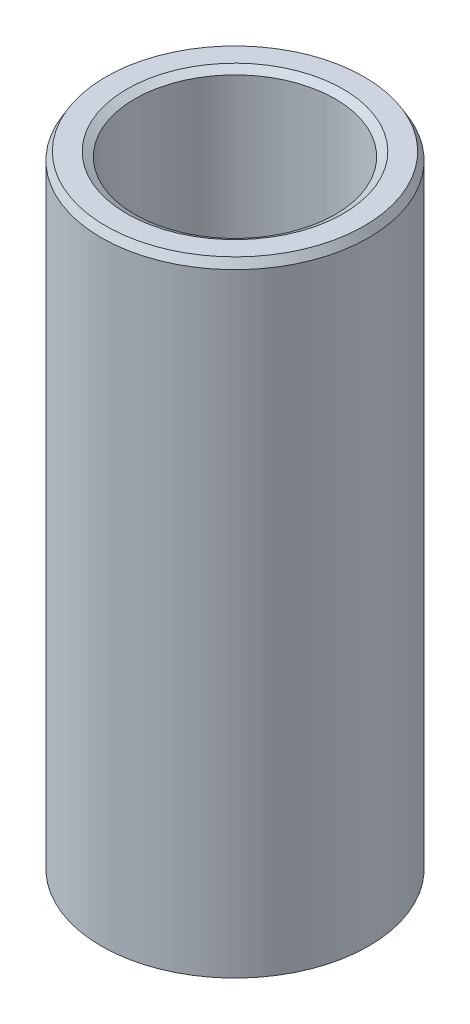
ISO-10303-21;
HEADER;
FILE_DESCRIPTION(('STEP AP214'),'2;1');
FILE_NAME('part.step','',(''),(''),'','','');
FILE_SCHEMA(('AUTOMOTIVE_DESIGN { 1 0 10303 214 1 1 1 1 }'));
ENDSEC;
DATA;
#1=APPLICATION_CONTEXT('core data for automotive mechanical design processes');
#2=APPLICATION_PROTOCOL_DEFINITION('international standard','automotive_design',2000,#1);
#3=PRODUCT_CONTEXT('',#1,'mechanical');
#4=PRODUCT('Part','Part','',(#3));
#5=PRODUCT_RELATED_PRODUCT_CATEGORY('part','',(#4));
#6=PRODUCT_DEFINITION_FORMATION('','',#4);
#7=PRODUCT_DEFINITION_CONTEXT('part definition',#1,'design');
#8=PRODUCT_DEFINITION('design','',#6,#7);
#9=PRODUCT_DEFINITION_SHAPE('','',#8);
#10=(LENGTH_UNIT() NAMED_UNIT(*) SI_UNIT(.MILLI.,.METRE.));
#11=(NAMED_UNIT(*) PLANE_ANGLE_UNIT() SI_UNIT($,.RADIAN.));
#12=(NAMED_UNIT(*) SI_UNIT($,.STERADIAN.) SOLID_ANGLE_UNIT());
#13=UNCERTAINTY_MEASURE_WITH_UNIT(LENGTH_MEASURE(1.E-05),#10,'distance_accuracy_value','');
#14=(GEOMETRIC_REPRESENTATION_CONTEXT(3) GLOBAL_UNCERTAINTY_ASSIGNED_CONTEXT((#13)) GLOBAL_UNIT_ASSIGNED_CONTEXT((#10,
#11,#12)) REPRESENTATION_CONTEXT('',''));
#15=CARTESIAN_POINT('',(0.,0.,0.));
#16=DIRECTION('',(0.,0.,1.));
#17=DIRECTION('',(1.,0.,0.));
#18=AXIS2_PLACEMENT_3D('',#15,#16,#17);
#19=CARTESIAN_POINT('',(0.,257.428573879402,0.));
#20=DIRECTION('',(0.,-1.,0.));
#21=DIRECTION('',(0.,0.,-1.));
#22=AXIS2_PLACEMENT_3D('',#19,#20,#21);
#23=CYLINDRICAL_SURFACE('',#22,55.);
#24=CARTESIAN_POINT('',(0.,1.87160884871462,0.));
#25=DIRECTION('',(0.,1.,0.));
#26=DIRECTION('',(0.,0.,1.));
#27=AXIS2_PLACEMENT_3D('',#24,#25,#26);
#28=CIRCLE('',#27,55.);
#29=CARTESIAN_POINT('',(0.,1.87160884871457,-55.));
#30=VERTEX_POINT('',#29);
#31=EDGE_CURVE('E10',#30,#30,#28,.T.);
#32=CARTESIAN_POINT('',(0.,254.186852261532,0.));
#33=DIRECTION('',(0.,1.,0.));
#34=DIRECTION('',(0.,0.,1.));
#35=AXIS2_PLACEMENT_3D('',#32,#33,#34);
#36=CIRCLE('',#35,55.);
#37=CARTESIAN_POINT('',(0.,254.186852261532,-55.));
#38=VERTEX_POINT('',#37);
#39=EDGE_CURVE('E50',#38,#38,#36,.F.);
#40=CARTESIAN_POINT('',(0.,1.87160884871457,-55.));
#41=CARTESIAN_POINT('',(0.,4.49989263426476,-55.));
#42=CARTESIAN_POINT('',(0.,7.12817641981495,-55.));
#43=CARTESIAN_POINT('',(0.,12.3847439909153,-55.));
#44=CARTESIAN_POINT('',(0.,15.0130277764655,-55.));
#45=CARTESIAN_POINT('',(0.,20.2695953475659,-55.));
#46=CARTESIAN_POINT('',(0.,22.897879133116,-55.));
#47=CARTESIAN_POINT('',(0.,28.1544467042164,-55.));
#48=CARTESIAN_POINT('',(0.,30.7827304897666,-55.));
#49=CARTESIAN_POINT('',(0.,36.039298060867,-55.));
#50=CARTESIAN_POINT('',(0.,38.6675818464172,-55.));
#51=CARTESIAN_POINT('',(0.,43.9241494175175,-55.));
#52=CARTESIAN_POINT('',(0.,46.5524332030677,-55.));
#53=CARTESIAN_POINT('',(0.,51.8090007741681,-55.));
#54=CARTESIAN_POINT('',(0.,54.4372845597183,-55.));
#55=CARTESIAN_POINT('',(0.,59.6938521308186,-55.));
#56=CARTESIAN_POINT('',(0.,62.3221359163688,-55.));
#57=CARTESIAN_POINT('',(0.,67.5787034874692,-55.));
#58=CARTESIAN_POINT('',(0.,70.2069872730194,-55.));
#59=CARTESIAN_POINT('',(0.,75.4635548441197,-55.));
#60=CARTESIAN_POINT('',(0.,78.0918386296699,-55.));
#61=CARTESIAN_POINT('',(0.,83.3484062007703,-55.));
#62=CARTESIAN_POINT('',(0.,85.9766899863205,-55.));
#63=CARTESIAN_POINT('',(0.,91.2332575574208,-55.));
#64=CARTESIAN_POINT('',(0.,93.861541342971,-55.));
#65=CARTESIAN_POINT('',(0.,99.1181089140714,-55.));
#66=CARTESIAN_POINT('',(0.,101.746392699622,-55.));
#67=CARTESIAN_POINT('',(0.,107.002960270722,-55.));
#68=CARTESIAN_POINT('',(0.,109.631244056272,-55.));
#69=CARTESIAN_POINT('',(0.,114.887811627373,-55.));
#70=CARTESIAN_POINT('',(0.,117.516095412923,-55.));
#71=CARTESIAN_POINT('',(0.,122.772662984023,-55.));
#72=CARTESIAN_POINT('',(0.,125.400946769573,-55.));
#73=CARTESIAN_POINT('',(0.,130.657514340674,-55.));
#74=CARTESIAN_POINT('',(0.,133.285798126224,-55.));
#75=CARTESIAN_POINT('',(0.,138.542365697324,-55.));
#76=CARTESIAN_POINT('',(0.,141.170649482874,-55.));
#77=CARTESIAN_POINT('',(0.,146.427217053975,-55.));
#78=CARTESIAN_POINT('',(0.,149.055500839525,-55.));
#79=CARTESIAN_POINT('',(0.,154.312068410625,-55.));
#80=CARTESIAN_POINT('',(0.,156.940352196175,-55.));
#81=CARTESIAN_POINT('',(0.,162.196919767276,-55.));
#82=CARTESIAN_POINT('',(0.,164.825203552826,-55.));
#83=CARTESIAN_POINT('',(0.,170.081771123926,-55.));
#84=CARTESIAN_POINT('',(0.,172.710054909477,-55.));
#85=CARTESIAN_POINT('',(0.,177.966622480577,-55.));
#86=CARTESIAN_POINT('',(0.,180.594906266127,-55.));
#87=CARTESIAN_POINT('',(0.,185.851473837228,-55.));
#88=CARTESIAN_POINT('',(0.,188.479757622778,-55.));
#89=CARTESIAN_POINT('',(0.,193.736325193878,-55.));
#90=CARTESIAN_POINT('',(0.,196.364608979428,-55.));
#91=CARTESIAN_POINT('',(0.,201.621176550529,-55.));
#92=CARTESIAN_POINT('',(0.,204.249460336079,-55.));
#93=CARTESIAN_POINT('',(0.,209.506027907179,-55.));
#94=CARTESIAN_POINT('',(0.,212.134311692729,-55.));
#95=CARTESIAN_POINT('',(0.,217.39087926383,-55.));
#96=CARTESIAN_POINT('',(0.,220.01916304938,-55.));
#97=CARTESIAN_POINT('',(0.,225.27573062048,-55.));
#98=CARTESIAN_POINT('',(0.,227.90401440603,-55.));
#99=CARTESIAN_POINT('',(0.,233.160581977131,-55.));
#100=CARTESIAN_POINT('',(0.,235.788865762681,-55.));
#101=CARTESIAN_POINT('',(0.,241.045433333781,-55.));
#102=CARTESIAN_POINT('',(0.,243.673717119332,-55.));
#103=CARTESIAN_POINT('',(0.,248.930284690432,-55.));
#104=CARTESIAN_POINT('',(0.,251.558568475982,-55.));
#105=CARTESIAN_POINT('',(0.,254.186852261532,-55.));
#106=B_SPLINE_CURVE_WITH_KNOTS('',3,(#40,#41,#42,#43,#44,#45,#46,#47,#48,#49,#50,#51,#52,#53,
#54,#55,#56,#57,#58,#59,#60,#61,#62,#63,#64,#65,#66,#67,#68,#69,#70,#71,#72,#73,#74,#75,#76,#77,
#78,#79,#80,#81,#82,#83,#84,#85,#86,#87,#88,#89,#90,#91,#92,#93,#94,#95,#96,#97,#98,#99,#100,
#101,#102,#103,#104,#105),.UNSPECIFIED.,.F.,.F.,(4,2,2,2,2,2,2,2,2,2,2,2,2,2,2,2,2,2,2,2,2,2,2,
2,2,2,2,2,2,2,2,2,4),(0.,7.88485135665057,15.7697027133011,23.6545540699517,31.5394054266022,
39.4242567832528,47.3091081399033,55.1939594965539,63.0788108532044,70.963662209855,
78.8485135665055,86.7333649231561,94.6182162798067,102.503067636457,110.387918993108,
118.272770349758,126.157621706409,134.042473063059,141.92732441971,149.812175776361,
157.697027133011,165.581878489662,173.466729846312,181.351581202963,189.236432559613,
197.121283916264,205.006135272914,212.890986629565,220.775837986216,228.660689342866,
236.545540699517,244.430392056167,252.315243412818),.UNSPECIFIED.);
#107=EDGE_CURVE('BSEAM39',#30,#38,#106,.T.);
#108=ORIENTED_EDGE('',*,*,#31,.T.);
#109=ORIENTED_EDGE('',*,*,#39,.T.);
#110=ORIENTED_EDGE('',*,*,#107,.T.);
#111=ORIENTED_EDGE('',*,*,#107,.F.);
#112=EDGE_LOOP('',(#108,#110,#109,#111));
#113=FACE_BOUND('',#112,.T.);
#114=ADVANCED_FACE('F39',(#113),#23,.T.);
#115=CARTESIAN_POINT('',(0.,257.428573879402,0.));
#116=DIRECTION('',(0.,1.,0.));
#117=DIRECTION('',(0.,0.,1.));
#118=AXIS2_PLACEMENT_3D('',#115,#116,#117);
#119=PLANE('',#118);
#120=CARTESIAN_POINT('',(0.,257.428573879402,0.));
#121=DIRECTION('',(0.,1.,0.));
#122=DIRECTION('',(0.,0.,1.));
#123=AXIS2_PLACEMENT_3D('',#120,#121,#122);
#124=CIRCLE('',#123,44.4456295604479);
#125=CARTESIAN_POINT('',(0.,257.428573879402,44.4456295604479));
#126=VERTEX_POINT('',#125);
#127=EDGE_CURVE('E58',#126,#126,#124,.F.);
#128=ORIENTED_EDGE('',*,*,#127,.T.);
#129=EDGE_LOOP('',(#128));
#130=FACE_BOUND('',#129,.T.);
#131=CARTESIAN_POINT('',(0.,257.428573879402,0.));
#132=DIRECTION('',(0.,1.,0.));
#133=DIRECTION('',(0.,0.,1.));
#134=AXIS2_PLACEMENT_3D('',#131,#132,#133);
#135=CIRCLE('',#134,53.1283911512853);
#136=CARTESIAN_POINT('',(0.,257.428573879402,-53.1283911512854));
#137=VERTEX_POINT('',#136);
#138=EDGE_CURVE('E61',#137,#137,#135,.T.);
#139=ORIENTED_EDGE('',*,*,#138,.T.);
#140=EDGE_LOOP('',(#139));
#141=FACE_BOUND('',#140,.T.);
#142=ADVANCED_FACE('F88',(#130,#141),#119,.T.);
#143=CARTESIAN_POINT('',(0.,0.,0.));
#144=DIRECTION('',(0.,1.,0.));
#145=DIRECTION('',(0.,0.,1.));
#146=AXIS2_PLACEMENT_3D('',#143,#144,#145);
#147=PLANE('',#146);
#148=CARTESIAN_POINT('',(0.,0.,0.));
#149=DIRECTION('',(0.,1.,0.));
#150=DIRECTION('',(0.,0.,1.));
#151=AXIS2_PLACEMENT_3D('',#148,#149,#150);
#152=CIRCLE('',#151,43.0755167912933);
#153=CARTESIAN_POINT('',(0.,0.,-43.0755167912933));
#154=VERTEX_POINT('',#153);
#155=EDGE_CURVE('E51',#154,#154,#152,.T.);
#156=ORIENTED_EDGE('',*,*,#155,.T.);
#157=EDGE_LOOP('',(#156));
#158=FACE_BOUND('',#157,.T.);
#159=CARTESIAN_POINT('',(0.,0.,0.));
#160=DIRECTION('',(0.,1.,0.));
#161=DIRECTION('',(0.,0.,1.));
#162=AXIS2_PLACEMENT_3D('',#159,#160,#161);
#163=CIRCLE('',#162,51.7582783821307);
#164=CARTESIAN_POINT('',(0.,0.,51.7582783821307));
#165=VERTEX_POINT('',#164);
#166=EDGE_CURVE('E54',#165,#165,#163,.F.);
#167=ORIENTED_EDGE('',*,*,#166,.T.);
#168=EDGE_LOOP('',(#167));
#169=FACE_BOUND('',#168,.T.);
#170=ADVANCED_FACE('F83',(#158,#169),#147,.F.);
#171=CARTESIAN_POINT('',(0.,257.428573879402,0.));
#172=DIRECTION('',(0.,-1.,0.));
#173=DIRECTION('',(0.,0.,-1.));
#174=AXIS2_PLACEMENT_3D('',#171,#172,#173);
#175=CYLINDRICAL_SURFACE('',#174,41.2039079425786);
#176=CARTESIAN_POINT('',(0.,255.556965030687,0.));
#177=DIRECTION('',(0.,1.,0.));
#178=DIRECTION('',(0.,0.,1.));
#179=AXIS2_PLACEMENT_3D('',#176,#177,#178);
#180=CIRCLE('',#179,41.2039079425786);
#181=CARTESIAN_POINT('',(0.,255.556965030687,41.2039079425786));
#182=VERTEX_POINT('',#181);
#183=EDGE_CURVE('E67',#182,#182,#180,.T.);
#184=ORIENTED_EDGE('',*,*,#183,.T.);
#185=EDGE_LOOP('',(#184));
#186=FACE_BOUND('',#185,.T.);
#187=CARTESIAN_POINT('',(0.,3.24172161786934,0.));
#188=DIRECTION('',(0.,1.,0.));
#189=DIRECTION('',(0.,0.,1.));
#190=AXIS2_PLACEMENT_3D('',#187,#188,#189);
#191=CIRCLE('',#190,41.2039079425786);
#192=CARTESIAN_POINT('',(0.,3.24172161786934,-41.2039079425786));
#193=VERTEX_POINT('',#192);
#194=EDGE_CURVE('E69',#193,#193,#191,.F.);
#195=ORIENTED_EDGE('',*,*,#194,.T.);
#196=EDGE_LOOP('',(#195));
#197=FACE_BOUND('',#196,.T.);
#198=ADVANCED_FACE('F71',(#186,#197),#175,.F.);
#199=CARTESIAN_POINT('',(0.,255.556965030687,0.));
#200=DIRECTION('',(0.,1.,0.));
#201=DIRECTION('',(0.,0.,1.));
#202=AXIS2_PLACEMENT_3D('',#199,#200,#201);
#203=CONICAL_SURFACE('',#202,41.2039079425786,1.0471975511966);
#204=ORIENTED_EDGE('',*,*,#127,.F.);
#205=EDGE_LOOP('',(#204));
#206=FACE_BOUND('',#205,.T.);
#207=ORIENTED_EDGE('',*,*,#183,.F.);
#208=EDGE_LOOP('',(#207));
#209=FACE_BOUND('',#208,.T.);
#210=ADVANCED_FACE('F77',(#206,#209),#203,.F.);
#211=CARTESIAN_POINT('',(0.,0.,0.));
#212=DIRECTION('',(0.,-1.,0.));
#213=DIRECTION('',(0.,0.,-1.));
#214=AXIS2_PLACEMENT_3D('',#211,#212,#213);
#215=CONICAL_SURFACE('',#214,43.0755167912933,0.523598775598295);
#216=CARTESIAN_POINT('',(0.,3.24172161786934,-41.2039079425786));
#217=CARTESIAN_POINT('',(0.,3.20795368434987,-41.223403868086));
#218=CARTESIAN_POINT('',(0.,3.1741857508304,-41.2428997935935));
#219=CARTESIAN_POINT('',(0.,3.10664988379145,-41.2818916446084));
#220=CARTESIAN_POINT('',(0.,3.07288195027198,-41.3013875701158));
#221=CARTESIAN_POINT('',(0.,3.00534608323303,-41.3403794211307));
#222=CARTESIAN_POINT('',(0.,2.97157814971356,-41.3598753466382));
#223=CARTESIAN_POINT('',(0.,2.90404228267462,-41.398867197653));
#224=CARTESIAN_POINT('',(0.,2.87027434915515,-41.4183631231605));
#225=CARTESIAN_POINT('',(0.,2.8027384821162,-41.4573549741754));
#226=CARTESIAN_POINT('',(0.,2.76897054859673,-41.4768508996828));
#227=CARTESIAN_POINT('',(0.,2.70143468155779,-41.5158427506977));
#228=CARTESIAN_POINT('',(0.,2.66766674803831,-41.5353386762051));
#229=CARTESIAN_POINT('',(0.,2.60013088099937,-41.57433052722));
#230=CARTESIAN_POINT('',(0.,2.5663629474799,-41.5938264527275));
#231=CARTESIAN_POINT('',(0.,2.49882708044095,-41.6328183037424));
#232=CARTESIAN_POINT('',(0.,2.46505914692148,-41.6523142292498));
#233=CARTESIAN_POINT('',(0.,2.39752327988253,-41.6913060802647));
#234=CARTESIAN_POINT('',(0.,2.36375534636306,-41.7108020057722));
#235=CARTESIAN_POINT('',(0.,2.29621947932412,-41.749793856787));
#236=CARTESIAN_POINT('',(0.,2.26245154580464,-41.7692897822945));
#237=CARTESIAN_POINT('',(0.,2.1949156787657,-41.8082816333094));
#238=CARTESIAN_POINT('',(0.,2.16114774524623,-41.8277775588168));
#239=CARTESIAN_POINT('',(0.,2.09361187820728,-41.8667694098317));
#240=CARTESIAN_POINT('',(0.,2.05984394468781,-41.8862653353392));
#241=CARTESIAN_POINT('',(0.,1.99230807764887,-41.925257186354));
#242=CARTESIAN_POINT('',(0.,1.95854014412939,-41.9447531118615));
#243=CARTESIAN_POINT('',(0.,1.89100427709045,-41.9837449628764));
#244=CARTESIAN_POINT('',(0.,1.85723634357098,-42.0032408883838));
#245=CARTESIAN_POINT('',(0.,1.78970047653203,-42.0422327393987));
#246=CARTESIAN_POINT('',(0.,1.75593254301256,-42.0617286649062));
#247=CARTESIAN_POINT('',(0.,1.68839667597362,-42.100720515921));
#248=CARTESIAN_POINT('',(0.,1.65462874245414,-42.1202164414285));
#249=CARTESIAN_POINT('',(0.,1.5870928754152,-42.1592082924434));
#250=CARTESIAN_POINT('',(0.,1.55332494189573,-42.1787042179508));
#251=CARTESIAN_POINT('',(0.,1.48578907485678,-42.2176960689657));
#252=CARTESIAN_POINT('',(0.,1.45202114133731,-42.2371919944732));
#253=CARTESIAN_POINT('',(0.,1.38448527429836,-42.276183845488));
#254=CARTESIAN_POINT('',(0.,1.35071734077889,-42.2956797709955));
#255=CARTESIAN_POINT('',(0.,1.28318147373995,-42.3346716220104));
#256=CARTESIAN_POINT('',(0.,1.24941354022048,-42.3541675475178));
#257=CARTESIAN_POINT('',(0.,1.18187767318153,-42.3931593985327));
#258=CARTESIAN_POINT('',(0.,1.14810973966206,-42.4126553240402));
#259=CARTESIAN_POINT('',(0.,1.08057387262311,-42.4516471750551));
#260=CARTESIAN_POINT('',(0.,1.04680593910364,-42.4711431005625));
#261=CARTESIAN_POINT('',(0.,0.979270072064696,-42.5101349515774));
#262=CARTESIAN_POINT('',(0.,0.945502138545225,-42.5296308770848));
#263=CARTESIAN_POINT('',(0.,0.87796627150628,-42.5686227280997));
#264=CARTESIAN_POINT('',(0.,0.844198337986808,-42.5881186536072));
#265=CARTESIAN_POINT('',(0.,0.776662470947863,-42.627110504622));
#266=CARTESIAN_POINT('',(0.,0.742894537428391,-42.6466064301295));
#267=CARTESIAN_POINT('',(0.,0.675358670389446,-42.6855982811444));
#268=CARTESIAN_POINT('',(0.,0.641590736869973,-42.7050942066518));
#269=CARTESIAN_POINT('',(0.,0.574054869831029,-42.7440860576667));
#270=CARTESIAN_POINT('',(0.,0.540286936311557,-42.7635819831742));
#271=CARTESIAN_POINT('',(0.,0.472751069272612,-42.802573834189));
#272=CARTESIAN_POINT('',(0.,0.43898313575314,-42.8220697596965));
#273=CARTESIAN_POINT('',(0.,0.371447268714195,-42.8610616107114));
#274=CARTESIAN_POINT('',(0.,0.337679335194724,-42.8805575362188));
#275=CARTESIAN_POINT('',(0.,0.270143468155779,-42.9195493872337));
#276=CARTESIAN_POINT('',(0.,0.236375534636306,-42.9390453127412));
#277=CARTESIAN_POINT('',(0.,0.168839667597361,-42.978037163756));
#278=CARTESIAN_POINT('',(0.,0.135071734077889,-42.9975330892635));
#279=CARTESIAN_POINT('',(0.,0.067535867038945,-43.0365249402784));
#280=CARTESIAN_POINT('',(0.,0.033767933519473,-43.0560208657858));
#281=CARTESIAN_POINT('',(0.,0.,-43.0755167912933));
#282=B_SPLINE_CURVE_WITH_KNOTS('',3,(#216,#217,#218,#219,#220,#221,#222,#223,#224,#225,#226,
#227,#228,#229,#230,#231,#232,#233,#234,#235,#236,#237,#238,#239,#240,#241,#242,#243,#244,#245,
#246,#247,#248,#249,#250,#251,#252,#253,#254,#255,#256,#257,#258,#259,#260,#261,#262,#263,#264,
#265,#266,#267,#268,#269,#270,#271,#272,#273,#274,#275,#276,#277,#278,#279,#280,#281),
.UNSPECIFIED.,.F.,.F.,(4,2,2,2,2,2,2,2,2,2,2,2,2,2,2,2,2,2,2,2,2,2,2,2,2,2,2,2,2,2,2,2,4),(0.,
0.116975553044669,0.233951106089335,0.350926659134004,0.467902212178673,0.584877765223341,
0.701853318268007,0.818828871312676,0.935804424357345,1.05277997740201,1.16975553044668,
1.28673108349135,1.40370663653602,1.52068218958069,1.63765774262535,1.75463329567002,
1.87160884871469,1.98858440175936,2.10555995480402,2.22253550784869,2.33951106089336,
2.45648661393803,2.5734621669827,2.69043772002737,2.80741327307204,2.9243888261167,
3.04136437916137,3.15833993220604,3.27531548525071,3.39229103829538,3.50926659134004,
3.62624214438471,3.74321769742938),.UNSPECIFIED.);
#283=EDGE_CURVE('BSEAM73',#193,#154,#282,.T.);
#284=ORIENTED_EDGE('',*,*,#194,.F.);
#285=ORIENTED_EDGE('',*,*,#155,.F.);
#286=ORIENTED_EDGE('',*,*,#283,.T.);
#287=ORIENTED_EDGE('',*,*,#283,.F.);
#288=EDGE_LOOP('',(#284,#286,#285,#287));
#289=FACE_BOUND('',#288,.T.);
#290=ADVANCED_FACE('F73',(#289),#215,.F.);
#291=CARTESIAN_POINT('',(0.,1.87160884871462,0.));
#292=DIRECTION('',(0.,1.,0.));
#293=DIRECTION('',(0.,0.,1.));
#294=AXIS2_PLACEMENT_3D('',#291,#292,#293);
#295=CONICAL_SURFACE('',#294,55.,1.0471975511966);
#296=ORIENTED_EDGE('',*,*,#166,.F.);
#297=EDGE_LOOP('',(#296));
#298=FACE_BOUND('',#297,.T.);
#299=ORIENTED_EDGE('',*,*,#31,.F.);
#300=EDGE_LOOP('',(#299));
#301=FACE_BOUND('',#300,.T.);
#302=ADVANCED_FACE('F76',(#298,#301),#295,.T.);
#303=CARTESIAN_POINT('',(0.,257.428573879402,0.));
#304=DIRECTION('',(0.,-1.,0.));
#305=DIRECTION('',(0.,0.,-1.));
#306=AXIS2_PLACEMENT_3D('',#303,#304,#305);
#307=CONICAL_SURFACE('',#306,53.1283911512853,0.523598775598291);
#308=CARTESIAN_POINT('',(0.,254.186852261532,-55.));
#309=CARTESIAN_POINT('',(0.,254.220620195052,-54.9805040744926));
#310=CARTESIAN_POINT('',(0.,254.254388128571,-54.9610081489851));
#311=CARTESIAN_POINT('',(0.,254.32192399561,-54.9220162979702));
#312=CARTESIAN_POINT('',(0.,254.35569192913,-54.9025203724628));
#313=CARTESIAN_POINT('',(0.,254.423227796169,-54.8635285214479));
#314=CARTESIAN_POINT('',(0.,254.456995729688,-54.8440325959405));
#315=CARTESIAN_POINT('',(0.,254.524531596727,-54.8050407449256));
#316=CARTESIAN_POINT('',(0.,254.558299530247,-54.7855448194181));
#317=CARTESIAN_POINT('',(0.,254.625835397285,-54.7465529684032));
#318=CARTESIAN_POINT('',(0.,254.659603330805,-54.7270570428958));
#319=CARTESIAN_POINT('',(0.,254.727139197844,-54.6880651918809));
#320=CARTESIAN_POINT('',(0.,254.760907131363,-54.6685692663735));
#321=CARTESIAN_POINT('',(0.,254.828442998402,-54.6295774153586));
#322=CARTESIAN_POINT('',(0.,254.862210931922,-54.6100814898511));
#323=CARTESIAN_POINT('',(0.,254.929746798961,-54.5710896388362));
#324=CARTESIAN_POINT('',(0.,254.96351473248,-54.5515937133288));
#325=CARTESIAN_POINT('',(0.,255.031050599519,-54.5126018623139));
#326=CARTESIAN_POINT('',(0.,255.064818533039,-54.4931059368065));
#327=CARTESIAN_POINT('',(0.,255.132354400078,-54.4541140857916));
#328=CARTESIAN_POINT('',(0.,255.166122333597,-54.4346181602841));
#329=CARTESIAN_POINT('',(0.,255.233658200636,-54.3956263092692));
#330=CARTESIAN_POINT('',(0.,255.267426134155,-54.3761303837618));
#331=CARTESIAN_POINT('',(0.,255.334962001194,-54.3371385327469));
#332=CARTESIAN_POINT('',(0.,255.368729934714,-54.3176426072394));
#333=CARTESIAN_POINT('',(0.,255.436265801753,-54.2786507562246));
#334=CARTESIAN_POINT('',(0.,255.470033735272,-54.2591548307171));
#335=CARTESIAN_POINT('',(0.,255.537569602311,-54.2201629797022));
#336=CARTESIAN_POINT('',(0.,255.571337535831,-54.2006670541948));
#337=CARTESIAN_POINT('',(0.,255.63887340287,-54.1616752031799));
#338=CARTESIAN_POINT('',(0.,255.672641336389,-54.1421792776725));
#339=CARTESIAN_POINT('',(0.,255.740177203428,-54.1031874266576));
#340=CARTESIAN_POINT('',(0.,255.773945136948,-54.0836915011501));
#341=CARTESIAN_POINT('',(0.,255.841481003986,-54.0446996501352));
#342=CARTESIAN_POINT('',(0.,255.875248937506,-54.0252037246278));
#343=CARTESIAN_POINT('',(0.,255.942784804545,-53.9862118736129));
#344=CARTESIAN_POINT('',(0.,255.976552738064,-53.9667159481055));
#345=CARTESIAN_POINT('',(0.,256.044088605103,-53.9277240970906));
#346=CARTESIAN_POINT('',(0.,256.077856538623,-53.9082281715831));
#347=CARTESIAN_POINT('',(0.,256.145392405662,-53.8692363205682));
#348=CARTESIAN_POINT('',(0.,256.179160339181,-53.8497403950608));
#349=CARTESIAN_POINT('',(0.,256.24669620622,-53.8107485440459));
#350=CARTESIAN_POINT('',(0.,256.28046413974,-53.7912526185385));
#351=CARTESIAN_POINT('',(0.,256.348000006779,-53.7522607675236));
#352=CARTESIAN_POINT('',(0.,256.381767940298,-53.7327648420161));
#353=CARTESIAN_POINT('',(0.,256.449303807337,-53.6937729910012));
#354=CARTESIAN_POINT('',(0.,256.483071740856,-53.6742770654938));
#355=CARTESIAN_POINT('',(0.,256.550607607895,-53.6352852144789));
#356=CARTESIAN_POINT('',(0.,256.584375541415,-53.6157892889715));
#357=CARTESIAN_POINT('',(0.,256.651911408454,-53.5767974379566));
#358=CARTESIAN_POINT('',(0.,256.685679341973,-53.5573015124491));
#359=CARTESIAN_POINT('',(0.,256.753215209012,-53.5183096614342));
#360=CARTESIAN_POINT('',(0.,256.786983142532,-53.4988137359268));
#361=CARTESIAN_POINT('',(0.,256.854519009571,-53.4598218849119));
#362=CARTESIAN_POINT('',(0.,256.88828694309,-53.4403259594045));
#363=CARTESIAN_POINT('',(0.,256.955822810129,-53.4013341083896));
#364=CARTESIAN_POINT('',(0.,256.989590743649,-53.3818381828821));
#365=CARTESIAN_POINT('',(0.,257.057126610687,-53.3428463318672));
#366=CARTESIAN_POINT('',(0.,257.090894544207,-53.3233504063598));
#367=CARTESIAN_POINT('',(0.,257.158430411246,-53.2843585553449));
#368=CARTESIAN_POINT('',(0.,257.192198344765,-53.2648626298375));
#369=CARTESIAN_POINT('',(0.,257.259734211804,-53.2258707788226));
#370=CARTESIAN_POINT('',(0.,257.293502145324,-53.2063748533151));
#371=CARTESIAN_POINT('',(0.,257.361038012363,-53.1673830023002));
#372=CARTESIAN_POINT('',(0.,257.394805945882,-53.1478870767928));
#373=CARTESIAN_POINT('',(0.,257.428573879402,-53.1283911512854));
#374=B_SPLINE_CURVE_WITH_KNOTS('',3,(#308,#309,#310,#311,#312,#313,#314,#315,#316,#317,#318,
#319,#320,#321,#322,#323,#324,#325,#326,#327,#328,#329,#330,#331,#332,#333,#334,#335,#336,#337,
#338,#339,#340,#341,#342,#343,#344,#345,#346,#347,#348,#349,#350,#351,#352,#353,#354,#355,#356,
#357,#358,#359,#360,#361,#362,#363,#364,#365,#366,#367,#368,#369,#370,#371,#372,#373),
.UNSPECIFIED.,.F.,.F.,(4,2,2,2,2,2,2,2,2,2,2,2,2,2,2,2,2,2,2,2,2,2,2,2,2,2,2,2,2,2,2,2,4),(0.,
0.116975553044694,0.233951106089343,0.350926659134041,0.467902212178687,0.584877765223385,
0.701853318268034,0.81882887131268,0.935804424357378,1.05277997740202,1.16975553044672,
1.28673108349137,1.40370663653602,1.52068218958071,1.63765774262536,1.75463329567006,
1.87160884871471,1.98858440175936,2.10555995480405,2.2225355078487,2.3395110608934,
2.45648661393804,2.57346216698269,2.69043772002739,2.80741327307204,2.92438882611673,
3.04136437916138,3.15833993220603,3.27531548525073,3.39229103829538,3.50926659134007,
3.62624214438472,3.74321769742942),.UNSPECIFIED.);
#375=EDGE_CURVE('BSEAM45',#38,#137,#374,.T.);
#376=ORIENTED_EDGE('',*,*,#39,.F.);
#377=ORIENTED_EDGE('',*,*,#138,.F.);
#378=ORIENTED_EDGE('',*,*,#375,.T.);
#379=ORIENTED_EDGE('',*,*,#375,.F.);
#380=EDGE_LOOP('',(#376,#378,#377,#379));
#381=FACE_BOUND('',#380,.T.);
#382=ADVANCED_FACE('F45',(#381),#307,.T.);
#383=CLOSED_SHELL('',(#114,#142,#170,#198,#210,#290,#302,#382));
#384=MANIFOLD_SOLID_BREP('B2',#383);
#385=ADVANCED_BREP_SHAPE_REPRESENTATION('',(#18,#384),#14);
#386=SHAPE_DEFINITION_REPRESENTATION(#9,#385);
ENDSEC;
END-ISO-10303-21;
